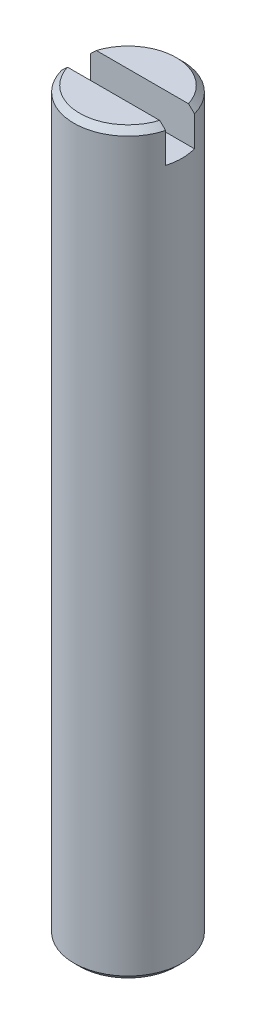
ISO-10303-21;
HEADER;
FILE_DESCRIPTION(('STEP AP214'),'2;1');
FILE_NAME('part.step','',(''),(''),'','','');
FILE_SCHEMA(('AUTOMOTIVE_DESIGN { 1 0 10303 214 1 1 1 1 }'));
ENDSEC;
DATA;
#1=APPLICATION_CONTEXT('core data for automotive mechanical design processes');
#2=APPLICATION_PROTOCOL_DEFINITION('international standard','automotive_design',2000,#1);
#3=PRODUCT_CONTEXT('',#1,'mechanical');
#4=PRODUCT('Part','Part','',(#3));
#5=PRODUCT_RELATED_PRODUCT_CATEGORY('part','',(#4));
#6=PRODUCT_DEFINITION_FORMATION('','',#4);
#7=PRODUCT_DEFINITION_CONTEXT('part definition',#1,'design');
#8=PRODUCT_DEFINITION('design','',#6,#7);
#9=PRODUCT_DEFINITION_SHAPE('','',#8);
#10=(LENGTH_UNIT() NAMED_UNIT(*) SI_UNIT(.MILLI.,.METRE.));
#11=(NAMED_UNIT(*) PLANE_ANGLE_UNIT() SI_UNIT($,.RADIAN.));
#12=(NAMED_UNIT(*) SI_UNIT($,.STERADIAN.) SOLID_ANGLE_UNIT());
#13=UNCERTAINTY_MEASURE_WITH_UNIT(LENGTH_MEASURE(1.E-05),#10,'distance_accuracy_value','');
#14=(GEOMETRIC_REPRESENTATION_CONTEXT(3) GLOBAL_UNCERTAINTY_ASSIGNED_CONTEXT((#13)) GLOBAL_UNIT_ASSIGNED_CONTEXT((#10,
#11,#12)) REPRESENTATION_CONTEXT('',''));
#15=CARTESIAN_POINT('',(0.,0.,0.));
#16=DIRECTION('',(0.,0.,1.));
#17=DIRECTION('',(1.,0.,0.));
#18=AXIS2_PLACEMENT_3D('',#15,#16,#17);
#19=CARTESIAN_POINT('',(0.,25.63,0.));
#20=DIRECTION('',(0.,1.,0.));
#21=DIRECTION('',(0.,0.,1.));
#22=AXIS2_PLACEMENT_3D('',#19,#20,#21);
#23=PLANE('',#22);
#24=DIRECTION('',(1.,0.,0.));
#25=VECTOR('',#24,1.);
#26=CARTESIAN_POINT('',(-1.92815303745489,25.63,0.5));
#27=LINE('',#26,#25);
#28=CARTESIAN_POINT('',(-1.59863222787482,25.63,0.5));
#29=VERTEX_POINT('',#28);
#30=CARTESIAN_POINT('',(1.59863222787482,25.63,0.5));
#31=VERTEX_POINT('',#30);
#32=EDGE_CURVE('E104',#29,#31,#27,.T.);
#33=ORIENTED_EDGE('',*,*,#32,.F.);
#34=CARTESIAN_POINT('',(0.,25.63,0.));
#35=DIRECTION('',(0.,1.,0.));
#36=DIRECTION('',(0.,0.,1.));
#37=AXIS2_PLACEMENT_3D('',#34,#35,#36);
#38=CIRCLE('',#37,1.675);
#39=EDGE_CURVE('E108',#29,#31,#38,.T.);
#40=ORIENTED_EDGE('',*,*,#39,.T.);
#41=EDGE_LOOP('',(#33,#40));
#42=FACE_BOUND('',#41,.T.);
#43=ADVANCED_FACE('F35',(#42),#23,.T.);
#44=CARTESIAN_POINT('',(0.,25.63,0.));
#45=DIRECTION('',(0.,-1.,0.));
#46=DIRECTION('',(0.,0.,-1.));
#47=AXIS2_PLACEMENT_3D('',#44,#45,#46);
#48=CONICAL_SURFACE('',#47,1.675,0.785398163397453);
#49=CARTESIAN_POINT('',(-1.80783032666232,25.4293,0.5));
#50=CARTESIAN_POINT('',(-1.73179500499544,25.5025434905063,0.5));
#51=CARTESIAN_POINT('',(-1.655631661438,25.5756574529306,0.5));
#52=CARTESIAN_POINT('',(-1.50278603127031,25.7213978913521,0.5));
#53=CARTESIAN_POINT('',(-1.42610356092213,25.7940241744425,0.5));
#54=CARTESIAN_POINT('',(-1.27331524971104,25.9372848902384,0.5));
#55=CARTESIAN_POINT('',(-1.19722155948933,26.0079322437088,0.5));
#56=CARTESIAN_POINT('',(-1.04389949696138,26.1479643360713,0.5));
#57=CARTESIAN_POINT('',(-0.966671338511255,26.2173493075493,0.5));
#58=CARTESIAN_POINT('',(-0.832389843916206,26.334373684446,0.5));
#59=CARTESIAN_POINT('',(-0.775842541337418,26.3825874682629,0.5));
#60=CARTESIAN_POINT('',(-0.68940947440133,26.4535213912139,0.5));
#61=CARTESIAN_POINT('',(-0.660185193646335,26.4770446912675,0.5));
#62=CARTESIAN_POINT('',(-0.601134130864876,26.5233198101178,0.5));
#63=CARTESIAN_POINT('',(-0.571307419234377,26.5460717182313,0.5));
#64=CARTESIAN_POINT('',(-0.510422818444442,26.5907887093017,0.5));
#65=CARTESIAN_POINT('',(-0.479353584451008,26.6127384796439,0.5));
#66=CARTESIAN_POINT('',(-0.4160308468356,26.6549823871207,0.5));
#67=CARTESIAN_POINT('',(-0.383775790375155,26.6752742324679,0.5));
#68=CARTESIAN_POINT('',(-0.318086074623362,26.7130015652193,0.5));
#69=CARTESIAN_POINT('',(-0.284668894822147,26.7304667777466,0.5));
#70=CARTESIAN_POINT('',(-0.216000499890124,26.7611997234653,0.5));
#71=CARTESIAN_POINT('',(-0.180755744097909,26.7744812037573,0.5));
#72=CARTESIAN_POINT('',(-0.111226291245192,26.7937684128345,0.5));
#73=CARTESIAN_POINT('',(-0.077087978866769,26.8002685700792,0.5));
#74=CARTESIAN_POINT('',(-0.0083042343826976,26.8060921884859,0.5));
#75=CARTESIAN_POINT('',(0.0263383470831139,26.805446733648,0.5));
#76=CARTESIAN_POINT('',(0.0945082865248326,26.7972777208545,0.5));
#77=CARTESIAN_POINT('',(0.128041535676751,26.7898000036987,0.5));
#78=CARTESIAN_POINT('',(0.177203447051402,26.7747617668835,0.5));
#79=CARTESIAN_POINT('',(0.193459702060004,26.7690835988158,0.5));
#80=CARTESIAN_POINT('',(0.225564104237349,26.7566742930377,0.5));
#81=CARTESIAN_POINT('',(0.24141232735736,26.7499433529653,0.5));
#82=CARTESIAN_POINT('',(0.286750726618894,26.7292174657799,0.5));
#83=CARTESIAN_POINT('',(0.315733318418337,26.7141201352363,0.5));
#84=CARTESIAN_POINT('',(0.372560991433742,26.6818991988556,0.5));
#85=CARTESIAN_POINT('',(0.400404688647456,26.6647732207499,0.5));
#86=CARTESIAN_POINT('',(0.455289685365193,26.6290912016616,0.5));
#87=CARTESIAN_POINT('',(0.482327862437765,26.6105304008226,0.5));
#88=CARTESIAN_POINT('',(0.535716231849224,26.5724398943554,0.5));
#89=CARTESIAN_POINT('',(0.56206625497991,26.552909953789,0.5));
#90=CARTESIAN_POINT('',(0.640972394115921,26.4928047647554,0.5));
#91=CARTESIAN_POINT('',(0.692717141351573,26.4511689495389,0.5));
#92=CARTESIAN_POINT('',(0.79478233225965,26.3664430905864,0.5));
#93=CARTESIAN_POINT('',(0.845105718377408,26.3233565292602,0.5));
#94=CARTESIAN_POINT('',(0.974903306213743,26.2100590352929,0.5));
#95=CARTESIAN_POINT('',(1.05372658548591,26.1391043101355,0.5));
#96=CARTESIAN_POINT('',(1.21028326563853,25.9958723244655,0.5));
#97=CARTESIAN_POINT('',(1.2880155897509,25.9235939001737,0.5));
#98=CARTESIAN_POINT('',(1.43969014027774,25.7811732381935,0.5));
#99=CARTESIAN_POINT('',(1.513660075319,25.7110604814735,0.5));
#100=CARTESIAN_POINT('',(1.66107048347285,25.5704392486943,0.5));
#101=CARTESIAN_POINT('',(1.73451144289194,25.4999312829262,0.5));
#102=CARTESIAN_POINT('',(1.80783032666232,25.4293,0.5));
#103=B_SPLINE_CURVE_WITH_KNOTS('',3,(#49,#50,#51,#52,#53,#54,#55,#56,#57,#58,#59,#60,#61,#62,
#63,#64,#65,#66,#67,#68,#69,#70,#71,#72,#73,#74,#75,#76,#77,#78,#79,#80,#81,#82,#83,#84,#85,#86,
#87,#88,#89,#90,#91,#92,#93,#94,#95,#96,#97,#98,#99,#100,#101,#102),.UNSPECIFIED.,.F.,.F.,(4,2,
2,2,2,2,2,2,2,2,2,2,2,2,2,2,2,2,2,2,2,2,2,2,2,2,4),(0.,0.316727050978584,0.63357276814389,
0.945064673377069,1.25649859485812,1.47939638475208,1.59193360632946,1.7044577527962,
1.81854438695636,1.93278614755144,2.04573510144217,2.15830895472388,2.26193430953509,
2.36510906329244,2.46759661321079,2.51922788711313,2.57084947982334,2.66875047387649,
2.76676710349092,2.86512413118557,2.96350512014589,3.16268635449067,3.36141947785009,
3.67955127642502,3.99797765259429,4.30372984208716,4.6091511853021),.UNSPECIFIED.);
#104=CARTESIAN_POINT('',(-1.80710403685012,25.43,0.5));
#105=VERTEX_POINT('',#104);
#106=EDGE_CURVE('E165',#105,#29,#103,.T.);
#107=ORIENTED_EDGE('',*,*,#106,.F.);
#108=CARTESIAN_POINT('',(0.,25.43,0.));
#109=DIRECTION('',(0.,1.,0.));
#110=DIRECTION('',(0.,0.,1.));
#111=AXIS2_PLACEMENT_3D('',#108,#109,#110);
#112=CIRCLE('',#111,1.875);
#113=CARTESIAN_POINT('',(1.80710403685012,25.43,0.5));
#114=VERTEX_POINT('',#113);
#115=EDGE_CURVE('E107',#114,#105,#112,.F.);
#116=ORIENTED_EDGE('',*,*,#115,.F.);
#117=EDGE_CURVE('E97',#31,#114,#103,.T.);
#118=ORIENTED_EDGE('',*,*,#117,.F.);
#119=ORIENTED_EDGE('',*,*,#39,.F.);
#120=EDGE_LOOP('',(#107,#116,#118,#119));
#121=FACE_BOUND('',#120,.T.);
#122=ADVANCED_FACE('F148',(#121),#48,.T.);
#123=CARTESIAN_POINT('',(0.,25.63,0.));
#124=DIRECTION('',(0.,-1.,0.));
#125=DIRECTION('',(0.,0.,-1.));
#126=AXIS2_PLACEMENT_3D('',#123,#124,#125);
#127=CYLINDRICAL_SURFACE('',#126,1.875);
#128=CARTESIAN_POINT('',(0.,24.38,0.));
#129=DIRECTION('',(0.,-1.,0.));
#130=DIRECTION('',(0.,0.,-1.));
#131=AXIS2_PLACEMENT_3D('',#128,#129,#130);
#132=CIRCLE('',#131,1.875);
#133=CARTESIAN_POINT('',(1.80710403685012,24.38,-0.5));
#134=VERTEX_POINT('',#133);
#135=CARTESIAN_POINT('',(1.80710403685012,24.38,0.5));
#136=VERTEX_POINT('',#135);
#137=EDGE_CURVE('E11',#134,#136,#132,.T.);
#138=ORIENTED_EDGE('',*,*,#137,.T.);
#139=DIRECTION('',(0.,-1.,0.));
#140=VECTOR('',#139,1.);
#141=CARTESIAN_POINT('',(1.80710403685012,25.63,0.5));
#142=LINE('',#141,#140);
#143=EDGE_CURVE('E175',#136,#114,#142,.F.);
#144=ORIENTED_EDGE('',*,*,#143,.T.);
#145=ORIENTED_EDGE('',*,*,#115,.T.);
#146=DIRECTION('',(0.,-1.,0.));
#147=VECTOR('',#146,1.);
#148=CARTESIAN_POINT('',(-1.80710403685012,25.63,0.5));
#149=LINE('',#148,#147);
#150=CARTESIAN_POINT('',(-1.80710403685012,24.38,0.5));
#151=VERTEX_POINT('',#150);
#152=EDGE_CURVE('E59',#105,#151,#149,.T.);
#153=ORIENTED_EDGE('',*,*,#152,.T.);
#154=CARTESIAN_POINT('',(-1.80710403685012,24.38,-0.5));
#155=VERTEX_POINT('',#154);
#156=EDGE_CURVE('E40',#151,#155,#132,.T.);
#157=ORIENTED_EDGE('',*,*,#156,.T.);
#158=DIRECTION('',(0.,-1.,0.));
#159=VECTOR('',#158,1.);
#160=CARTESIAN_POINT('',(-1.80710403685012,25.63,-0.5));
#161=LINE('',#160,#159);
#162=CARTESIAN_POINT('',(-1.80710403685012,25.43,-0.5));
#163=VERTEX_POINT('',#162);
#164=EDGE_CURVE('E169',#155,#163,#161,.F.);
#165=ORIENTED_EDGE('',*,*,#164,.T.);
#166=CARTESIAN_POINT('',(1.80710403685012,25.43,-0.5));
#167=VERTEX_POINT('',#166);
#168=EDGE_CURVE('E111',#163,#167,#112,.F.);
#169=ORIENTED_EDGE('',*,*,#168,.T.);
#170=DIRECTION('',(0.,-1.,0.));
#171=VECTOR('',#170,1.);
#172=CARTESIAN_POINT('',(1.80710403685012,25.63,-0.5));
#173=LINE('',#172,#171);
#174=EDGE_CURVE('E92',#167,#134,#173,.T.);
#175=ORIENTED_EDGE('',*,*,#174,.T.);
#176=EDGE_LOOP('',(#138,#144,#145,#153,#157,#165,#169,#175));
#177=FACE_BOUND('',#176,.T.);
#178=CARTESIAN_POINT('',(0.,0.199999999999999,0.));
#179=DIRECTION('',(0.,1.,0.));
#180=DIRECTION('',(0.,0.,1.));
#181=AXIS2_PLACEMENT_3D('',#178,#179,#180);
#182=CIRCLE('',#181,1.875);
#183=CARTESIAN_POINT('',(0.,0.199999999999999,1.875));
#184=VERTEX_POINT('',#183);
#185=EDGE_CURVE('E117',#184,#184,#182,.T.);
#186=ORIENTED_EDGE('',*,*,#185,.T.);
#187=EDGE_LOOP('',(#186));
#188=FACE_BOUND('',#187,.T.);
#189=ADVANCED_FACE('F144',(#177,#188),#127,.T.);
#190=DIRECTION('',(-1.,0.,0.));
#191=VECTOR('',#190,1.);
#192=CARTESIAN_POINT('',(-1.92815303745489,25.63,-0.5));
#193=LINE('',#192,#191);
#194=CARTESIAN_POINT('',(1.59863222787482,25.63,-0.5));
#195=VERTEX_POINT('',#194);
#196=CARTESIAN_POINT('',(-1.59863222787482,25.63,-0.5));
#197=VERTEX_POINT('',#196);
#198=EDGE_CURVE('E51',#195,#197,#193,.T.);
#199=ORIENTED_EDGE('',*,*,#198,.F.);
#200=EDGE_CURVE('E103',#195,#197,#38,.T.);
#201=ORIENTED_EDGE('',*,*,#200,.T.);
#202=EDGE_LOOP('',(#199,#201));
#203=FACE_BOUND('',#202,.T.);
#204=ADVANCED_FACE('F102',(#203),#23,.T.);
#205=CARTESIAN_POINT('',(0.,0.,0.));
#206=DIRECTION('',(0.,1.,0.));
#207=DIRECTION('',(0.,0.,1.));
#208=AXIS2_PLACEMENT_3D('',#205,#206,#207);
#209=PLANE('',#208);
#210=CARTESIAN_POINT('',(0.,0.,0.));
#211=DIRECTION('',(0.,1.,0.));
#212=DIRECTION('',(0.,0.,1.));
#213=AXIS2_PLACEMENT_3D('',#210,#211,#212);
#214=CIRCLE('',#213,1.675);
#215=CARTESIAN_POINT('',(0.,0.,1.675));
#216=VERTEX_POINT('',#215);
#217=EDGE_CURVE('E120',#216,#216,#214,.F.);
#218=ORIENTED_EDGE('',*,*,#217,.T.);
#219=EDGE_LOOP('',(#218));
#220=FACE_BOUND('',#219,.T.);
#221=ADVANCED_FACE('F143',(#220),#209,.F.);
#222=CARTESIAN_POINT('',(1.80783032666232,25.4293,-0.5));
#223=CARTESIAN_POINT('',(1.73179500499544,25.5025434905063,-0.5));
#224=CARTESIAN_POINT('',(1.655631661438,25.5756574529306,-0.5));
#225=CARTESIAN_POINT('',(1.50278603127031,25.7213978913521,-0.5));
#226=CARTESIAN_POINT('',(1.42610356092213,25.7940241744425,-0.5));
#227=CARTESIAN_POINT('',(1.27331524971104,25.9372848902384,-0.5));
#228=CARTESIAN_POINT('',(1.19722155948933,26.0079322437088,-0.5));
#229=CARTESIAN_POINT('',(1.04389949696138,26.1479643360713,-0.5));
#230=CARTESIAN_POINT('',(0.966671338511255,26.2173493075493,-0.5));
#231=CARTESIAN_POINT('',(0.832389843916208,26.334373684446,-0.5));
#232=CARTESIAN_POINT('',(0.77584254133742,26.3825874682629,-0.5));
#233=CARTESIAN_POINT('',(0.689409474401332,26.4535213912139,-0.5));
#234=CARTESIAN_POINT('',(0.660185193646336,26.4770446912675,-0.5));
#235=CARTESIAN_POINT('',(0.601134130864879,26.5233198101178,-0.5));
#236=CARTESIAN_POINT('',(0.571307419234381,26.5460717182313,-0.5));
#237=CARTESIAN_POINT('',(0.510422818444446,26.5907887093017,-0.5));
#238=CARTESIAN_POINT('',(0.479353584451011,26.6127384796439,-0.5));
#239=CARTESIAN_POINT('',(0.416030846835602,26.6549823871207,-0.5));
#240=CARTESIAN_POINT('',(0.383775790375158,26.6752742324679,-0.5));
#241=CARTESIAN_POINT('',(0.318086074623366,26.7130015652193,-0.5));
#242=CARTESIAN_POINT('',(0.28466889482215,26.7304667777466,-0.5));
#243=CARTESIAN_POINT('',(0.216000499890127,26.7611997234653,-0.5));
#244=CARTESIAN_POINT('',(0.180755744097912,26.7744812037573,-0.5));
#245=CARTESIAN_POINT('',(0.111226291245195,26.7937684128345,-0.5));
#246=CARTESIAN_POINT('',(0.0770879788667719,26.8002685700792,-0.5));
#247=CARTESIAN_POINT('',(0.00830423438270012,26.8060921884859,-0.5));
#248=CARTESIAN_POINT('',(-0.0263383470831114,26.805446733648,-0.5));
#249=CARTESIAN_POINT('',(-0.094508286524831,26.7972777208545,-0.5));
#250=CARTESIAN_POINT('',(-0.128041535676751,26.7898000036987,-0.5));
#251=CARTESIAN_POINT('',(-0.177203447051402,26.7747617668835,-0.5));
#252=CARTESIAN_POINT('',(-0.193459702060003,26.7690835988158,-0.5));
#253=CARTESIAN_POINT('',(-0.225564104237348,26.7566742930377,-0.5));
#254=CARTESIAN_POINT('',(-0.241412327357358,26.7499433529653,-0.5));
#255=CARTESIAN_POINT('',(-0.286750726618892,26.7292174657799,-0.5));
#256=CARTESIAN_POINT('',(-0.315733318418336,26.7141201352363,-0.5));
#257=CARTESIAN_POINT('',(-0.372560991433741,26.6818991988556,-0.5));
#258=CARTESIAN_POINT('',(-0.400404688647455,26.6647732207499,-0.5));
#259=CARTESIAN_POINT('',(-0.455289685365191,26.6290912016616,-0.5));
#260=CARTESIAN_POINT('',(-0.482327862437761,26.6105304008226,-0.5));
#261=CARTESIAN_POINT('',(-0.535716231849219,26.5724398943554,-0.5));
#262=CARTESIAN_POINT('',(-0.562066254979906,26.552909953789,-0.5));
#263=CARTESIAN_POINT('',(-0.640972394115916,26.4928047647554,-0.5));
#264=CARTESIAN_POINT('',(-0.692717141351567,26.4511689495389,-0.5));
#265=CARTESIAN_POINT('',(-0.794782332259642,26.3664430905864,-0.5));
#266=CARTESIAN_POINT('',(-0.8451057183774,26.3233565292602,-0.5));
#267=CARTESIAN_POINT('',(-0.974903306213735,26.2100590352929,-0.5));
#268=CARTESIAN_POINT('',(-1.0537265854859,26.1391043101355,-0.5));
#269=CARTESIAN_POINT('',(-1.21028326563853,25.9958723244655,-0.5));
#270=CARTESIAN_POINT('',(-1.2880155897509,25.9235939001737,-0.5));
#271=CARTESIAN_POINT('',(-1.43969014027773,25.7811732381935,-0.5));
#272=CARTESIAN_POINT('',(-1.513660075319,25.7110604814735,-0.5));
#273=CARTESIAN_POINT('',(-1.66107048347285,25.5704392486943,-0.5));
#274=CARTESIAN_POINT('',(-1.73451144289194,25.4999312829262,-0.5));
#275=CARTESIAN_POINT('',(-1.80783032666232,25.4293,-0.5));
#276=B_SPLINE_CURVE_WITH_KNOTS('',3,(#222,#223,#224,#225,#226,#227,#228,#229,#230,#231,#232,
#233,#234,#235,#236,#237,#238,#239,#240,#241,#242,#243,#244,#245,#246,#247,#248,#249,#250,#251,
#252,#253,#254,#255,#256,#257,#258,#259,#260,#261,#262,#263,#264,#265,#266,#267,#268,#269,#270,
#271,#272,#273,#274,#275),.UNSPECIFIED.,.F.,.F.,(4,2,2,2,2,2,2,2,2,2,2,2,2,2,2,2,2,2,2,2,2,2,2,
2,2,2,4),(0.,0.316727050978581,0.63357276814389,0.945064673377069,1.25649859485811,
1.47939638475208,1.59193360632946,1.70445775279619,1.81854438695636,1.93278614755144,
2.04573510144217,2.15830895472388,2.26193430953509,2.36510906329244,2.46759661321079,
2.51922788711313,2.57084947982333,2.66875047387649,2.76676710349092,2.86512413118556,
2.96350512014589,3.16268635449066,3.36141947785008,3.67955127642501,3.99797765259428,
4.30372984208716,4.6091511853021),.UNSPECIFIED.);
#277=EDGE_CURVE('E88',#167,#195,#276,.T.);
#278=ORIENTED_EDGE('',*,*,#277,.F.);
#279=ORIENTED_EDGE('',*,*,#168,.F.);
#280=EDGE_CURVE('E98',#197,#163,#276,.T.);
#281=ORIENTED_EDGE('',*,*,#280,.F.);
#282=ORIENTED_EDGE('',*,*,#200,.F.);
#283=EDGE_LOOP('',(#278,#279,#281,#282));
#284=FACE_BOUND('',#283,.T.);
#285=ADVANCED_FACE('F106',(#284),#48,.T.);
#286=CARTESIAN_POINT('',(0.,0.199999999999999,0.));
#287=DIRECTION('',(0.,1.,0.));
#288=DIRECTION('',(0.,0.,1.));
#289=AXIS2_PLACEMENT_3D('',#286,#287,#288);
#290=CONICAL_SURFACE('',#289,1.875,0.785398163397452);
#291=ORIENTED_EDGE('',*,*,#217,.F.);
#292=EDGE_LOOP('',(#291));
#293=FACE_BOUND('',#292,.T.);
#294=ORIENTED_EDGE('',*,*,#185,.F.);
#295=EDGE_LOOP('',(#294));
#296=FACE_BOUND('',#295,.T.);
#297=ADVANCED_FACE('F38',(#293,#296),#290,.T.);
#298=CARTESIAN_POINT('',(0.,24.38,0.));
#299=DIRECTION('',(0.,-1.,0.));
#300=DIRECTION('',(0.,0.,-1.));
#301=AXIS2_PLACEMENT_3D('',#298,#299,#300);
#302=PLANE('',#301);
#303=DIRECTION('',(-1.,0.,0.));
#304=VECTOR('',#303,1.);
#305=CARTESIAN_POINT('',(-1.92815303745489,24.38,-0.5));
#306=LINE('',#305,#304);
#307=EDGE_CURVE('E162',#134,#155,#306,.T.);
#308=ORIENTED_EDGE('',*,*,#307,.T.);
#309=ORIENTED_EDGE('',*,*,#156,.F.);
#310=DIRECTION('',(1.,0.,0.));
#311=VECTOR('',#310,1.);
#312=CARTESIAN_POINT('',(-1.92815303745489,24.38,0.5));
#313=LINE('',#312,#311);
#314=EDGE_CURVE('E174',#151,#136,#313,.T.);
#315=ORIENTED_EDGE('',*,*,#314,.T.);
#316=ORIENTED_EDGE('',*,*,#137,.F.);
#317=EDGE_LOOP('',(#308,#309,#315,#316));
#318=FACE_BOUND('',#317,.T.);
#319=ADVANCED_FACE('F173',(#318),#302,.F.);
#320=CARTESIAN_POINT('',(-1.92815303745489,24.38,0.5));
#321=DIRECTION('',(0.,0.,1.));
#322=DIRECTION('',(1.,0.,0.));
#323=AXIS2_PLACEMENT_3D('',#320,#321,#322);
#324=PLANE('',#323);
#325=ORIENTED_EDGE('',*,*,#106,.T.);
#326=ORIENTED_EDGE('',*,*,#32,.T.);
#327=ORIENTED_EDGE('',*,*,#117,.T.);
#328=ORIENTED_EDGE('',*,*,#143,.F.);
#329=ORIENTED_EDGE('',*,*,#314,.F.);
#330=ORIENTED_EDGE('',*,*,#152,.F.);
#331=EDGE_LOOP('',(#325,#326,#327,#328,#329,#330));
#332=FACE_BOUND('',#331,.T.);
#333=ADVANCED_FACE('F138',(#332),#324,.F.);
#334=CARTESIAN_POINT('',(-1.92815303745489,24.38,-0.5));
#335=DIRECTION('',(0.,0.,-1.));
#336=DIRECTION('',(-1.,0.,0.));
#337=AXIS2_PLACEMENT_3D('',#334,#335,#336);
#338=PLANE('',#337);
#339=ORIENTED_EDGE('',*,*,#277,.T.);
#340=ORIENTED_EDGE('',*,*,#198,.T.);
#341=ORIENTED_EDGE('',*,*,#280,.T.);
#342=ORIENTED_EDGE('',*,*,#164,.F.);
#343=ORIENTED_EDGE('',*,*,#307,.F.);
#344=ORIENTED_EDGE('',*,*,#174,.F.);
#345=EDGE_LOOP('',(#339,#340,#341,#342,#343,#344));
#346=FACE_BOUND('',#345,.T.);
#347=ADVANCED_FACE('F89',(#346),#338,.F.);
#348=CLOSED_SHELL('',(#43,#122,#189,#204,#221,#285,#297,#319,#333,#347));
#349=MANIFOLD_SOLID_BREP('B2',#348);
#350=ADVANCED_BREP_SHAPE_REPRESENTATION('',(#18,#349),#14);
#351=SHAPE_DEFINITION_REPRESENTATION(#9,#350);
ENDSEC;
END-ISO-10303-21;
